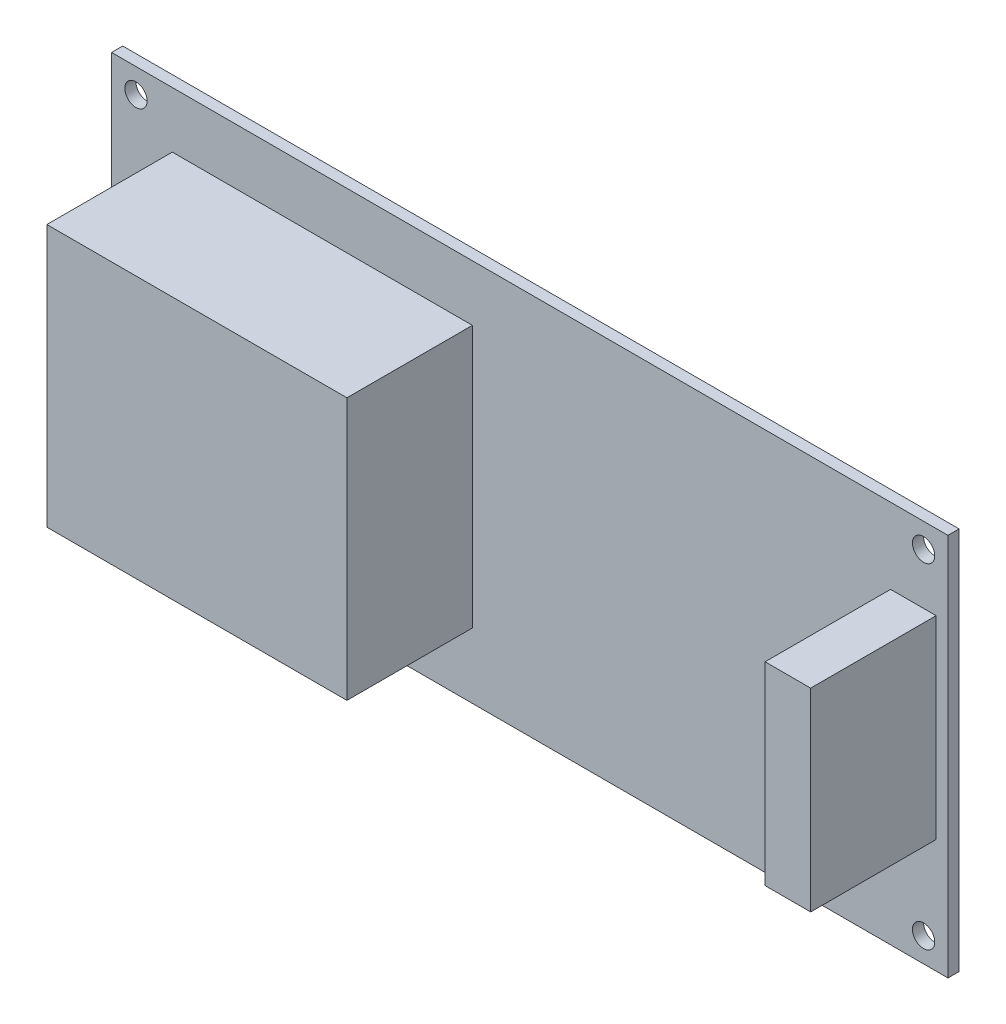
ISO-10303-21;
HEADER;
FILE_DESCRIPTION(('STEP AP214'),'2;1');
FILE_NAME('part.step','',(''),(''),'','','');
FILE_SCHEMA(('AUTOMOTIVE_DESIGN { 1 0 10303 214 1 1 1 1 }'));
ENDSEC;
DATA;
#1=APPLICATION_CONTEXT('core data for automotive mechanical design processes');
#2=APPLICATION_PROTOCOL_DEFINITION('international standard','automotive_design',2000,#1);
#3=PRODUCT_CONTEXT('',#1,'mechanical');
#4=PRODUCT('Part','Part','',(#3));
#5=PRODUCT_RELATED_PRODUCT_CATEGORY('part','',(#4));
#6=PRODUCT_DEFINITION_FORMATION('','',#4);
#7=PRODUCT_DEFINITION_CONTEXT('part definition',#1,'design');
#8=PRODUCT_DEFINITION('design','',#6,#7);
#9=PRODUCT_DEFINITION_SHAPE('','',#8);
#10=(LENGTH_UNIT() NAMED_UNIT(*) SI_UNIT(.MILLI.,.METRE.));
#11=(NAMED_UNIT(*) PLANE_ANGLE_UNIT() SI_UNIT($,.RADIAN.));
#12=(NAMED_UNIT(*) SI_UNIT($,.STERADIAN.) SOLID_ANGLE_UNIT());
#13=UNCERTAINTY_MEASURE_WITH_UNIT(LENGTH_MEASURE(1.E-05),#10,'distance_accuracy_value','');
#14=(GEOMETRIC_REPRESENTATION_CONTEXT(3) GLOBAL_UNCERTAINTY_ASSIGNED_CONTEXT((#13)) GLOBAL_UNIT_ASSIGNED_CONTEXT((#10,
#11,#12)) REPRESENTATION_CONTEXT('',''));
#15=CARTESIAN_POINT('',(0.,0.,0.));
#16=DIRECTION('',(0.,0.,1.));
#17=DIRECTION('',(1.,0.,0.));
#18=AXIS2_PLACEMENT_3D('',#15,#16,#17);
#19=CARTESIAN_POINT('',(0.,0.,1.6));
#20=DIRECTION('',(0.,0.,1.));
#21=DIRECTION('',(1.,0.,0.));
#22=AXIS2_PLACEMENT_3D('',#19,#20,#21);
#23=PLANE('',#22);
#24=DIRECTION('',(0.,-1.,0.));
#25=VECTOR('',#24,1.);
#26=CARTESIAN_POINT('',(-8.23253103883559,0.,1.6));
#27=LINE('',#26,#25);
#28=CARTESIAN_POINT('',(-8.23253103883559,19.4768407043568,1.6));
#29=VERTEX_POINT('',#28);
#30=CARTESIAN_POINT('',(-8.23253103883559,-18.1267238571365,1.6));
#31=VERTEX_POINT('',#30);
#32=EDGE_CURVE('E147',#29,#31,#27,.T.);
#33=ORIENTED_EDGE('',*,*,#32,.T.);
#34=DIRECTION('',(1.,0.,0.));
#35=VECTOR('',#34,1.);
#36=CARTESIAN_POINT('',(0.,-18.1267238571365,1.6));
#37=LINE('',#36,#35);
#38=CARTESIAN_POINT('',(-51.2828434672272,-18.1267238571365,1.6));
#39=VERTEX_POINT('',#38);
#40=EDGE_CURVE('E167',#39,#31,#37,.T.);
#41=ORIENTED_EDGE('',*,*,#40,.F.);
#42=DIRECTION('',(0.,-1.,0.));
#43=VECTOR('',#42,1.);
#44=CARTESIAN_POINT('',(-51.2828434672272,0.,1.6));
#45=LINE('',#44,#43);
#46=CARTESIAN_POINT('',(-51.2828434672272,19.4768407043568,1.6));
#47=VERTEX_POINT('',#46);
#48=EDGE_CURVE('E177',#47,#39,#45,.T.);
#49=ORIENTED_EDGE('',*,*,#48,.F.);
#50=DIRECTION('',(1.,0.,0.));
#51=VECTOR('',#50,1.);
#52=CARTESIAN_POINT('',(0.,19.4768407043568,1.6));
#53=LINE('',#52,#51);
#54=EDGE_CURVE('E150',#47,#29,#53,.T.);
#55=ORIENTED_EDGE('',*,*,#54,.T.);
#56=EDGE_LOOP('',(#33,#41,#49,#55));
#57=FACE_BOUND('',#56,.T.);
#58=CARTESIAN_POINT('',(56.5,-24.,1.6));
#59=DIRECTION('',(0.,0.,1.));
#60=DIRECTION('',(1.,0.,0.));
#61=AXIS2_PLACEMENT_3D('',#58,#59,#60);
#62=CIRCLE('',#61,1.6);
#63=CARTESIAN_POINT('',(58.1,-24.,1.6));
#64=VERTEX_POINT('',#63);
#65=EDGE_CURVE('E193',#64,#64,#62,.T.);
#66=ORIENTED_EDGE('',*,*,#65,.F.);
#67=EDGE_LOOP('',(#66));
#68=FACE_BOUND('',#67,.T.);
#69=CARTESIAN_POINT('',(-56.5,24.,1.6));
#70=DIRECTION('',(0.,0.,1.));
#71=DIRECTION('',(1.,0.,0.));
#72=AXIS2_PLACEMENT_3D('',#69,#70,#71);
#73=CIRCLE('',#72,1.6);
#74=CARTESIAN_POINT('',(-54.9,24.,1.6));
#75=VERTEX_POINT('',#74);
#76=EDGE_CURVE('E205',#75,#75,#73,.T.);
#77=ORIENTED_EDGE('',*,*,#76,.F.);
#78=EDGE_LOOP('',(#77));
#79=FACE_BOUND('',#78,.T.);
#80=DIRECTION('',(0.,-1.,0.));
#81=VECTOR('',#80,1.);
#82=CARTESIAN_POINT('',(-60.,27.5,1.6));
#83=LINE('',#82,#81);
#84=CARTESIAN_POINT('',(-60.,27.5,1.6));
#85=VERTEX_POINT('',#84);
#86=CARTESIAN_POINT('',(-60.,-27.5,1.6));
#87=VERTEX_POINT('',#86);
#88=EDGE_CURVE('E211',#85,#87,#83,.T.);
#89=ORIENTED_EDGE('',*,*,#88,.T.);
#90=DIRECTION('',(1.,0.,0.));
#91=VECTOR('',#90,1.);
#92=CARTESIAN_POINT('',(-60.,-27.5,1.6));
#93=LINE('',#92,#91);
#94=CARTESIAN_POINT('',(60.,-27.5,1.6));
#95=VERTEX_POINT('',#94);
#96=EDGE_CURVE('E214',#87,#95,#93,.T.);
#97=ORIENTED_EDGE('',*,*,#96,.T.);
#98=DIRECTION('',(0.,1.,0.));
#99=VECTOR('',#98,1.);
#100=CARTESIAN_POINT('',(60.,27.5,1.6));
#101=LINE('',#100,#99);
#102=CARTESIAN_POINT('',(60.,27.5,1.6));
#103=VERTEX_POINT('',#102);
#104=EDGE_CURVE('E217',#95,#103,#101,.T.);
#105=ORIENTED_EDGE('',*,*,#104,.T.);
#106=DIRECTION('',(-1.,0.,0.));
#107=VECTOR('',#106,1.);
#108=CARTESIAN_POINT('',(-60.,27.5,1.6));
#109=LINE('',#108,#107);
#110=EDGE_CURVE('E219',#103,#85,#109,.T.);
#111=ORIENTED_EDGE('',*,*,#110,.T.);
#112=EDGE_LOOP('',(#89,#97,#105,#111));
#113=FACE_BOUND('',#112,.T.);
#114=CARTESIAN_POINT('',(56.5,24.,1.6));
#115=DIRECTION('',(0.,0.,1.));
#116=DIRECTION('',(1.,0.,0.));
#117=AXIS2_PLACEMENT_3D('',#114,#115,#116);
#118=CIRCLE('',#117,1.6);
#119=CARTESIAN_POINT('',(58.1,24.,1.6));
#120=VERTEX_POINT('',#119);
#121=EDGE_CURVE('E199',#120,#120,#118,.T.);
#122=ORIENTED_EDGE('',*,*,#121,.F.);
#123=EDGE_LOOP('',(#122));
#124=FACE_BOUND('',#123,.T.);
#125=CARTESIAN_POINT('',(-56.5,-24.,1.6));
#126=DIRECTION('',(0.,0.,1.));
#127=DIRECTION('',(1.,0.,0.));
#128=AXIS2_PLACEMENT_3D('',#125,#126,#127);
#129=CIRCLE('',#128,1.6);
#130=CARTESIAN_POINT('',(-54.9,-24.,1.6));
#131=VERTEX_POINT('',#130);
#132=EDGE_CURVE('E187',#131,#131,#129,.T.);
#133=ORIENTED_EDGE('',*,*,#132,.F.);
#134=EDGE_LOOP('',(#133));
#135=FACE_BOUND('',#134,.T.);
#136=DIRECTION('',(0.,-1.,0.));
#137=VECTOR('',#136,1.);
#138=CARTESIAN_POINT('',(58.2996946635816,16.6696828347597,1.6));
#139=LINE('',#138,#137);
#140=CARTESIAN_POINT('',(58.2996946635816,16.6696828347597,1.6));
#141=VERTEX_POINT('',#140);
#142=CARTESIAN_POINT('',(58.2996946635816,-11.1451647953231,1.6));
#143=VERTEX_POINT('',#142);
#144=EDGE_CURVE('E146',#141,#143,#139,.T.);
#145=ORIENTED_EDGE('',*,*,#144,.T.);
#146=DIRECTION('',(1.,0.,0.));
#147=VECTOR('',#146,1.);
#148=CARTESIAN_POINT('',(51.7604993249776,-11.1451647953231,1.6));
#149=LINE('',#148,#147);
#150=CARTESIAN_POINT('',(51.7604993249776,-11.1451647953231,1.6));
#151=VERTEX_POINT('',#150);
#152=EDGE_CURVE('E141',#151,#143,#149,.T.);
#153=ORIENTED_EDGE('',*,*,#152,.F.);
#154=DIRECTION('',(0.,-1.,0.));
#155=VECTOR('',#154,1.);
#156=CARTESIAN_POINT('',(51.7604993249776,16.6696828347597,1.6));
#157=LINE('',#156,#155);
#158=CARTESIAN_POINT('',(51.7604993249776,16.6696828347597,1.6));
#159=VERTEX_POINT('',#158);
#160=EDGE_CURVE('E126',#159,#151,#157,.T.);
#161=ORIENTED_EDGE('',*,*,#160,.F.);
#162=DIRECTION('',(1.,0.,0.));
#163=VECTOR('',#162,1.);
#164=CARTESIAN_POINT('',(51.7604993249776,16.6696828347597,1.6));
#165=LINE('',#164,#163);
#166=EDGE_CURVE('E50',#159,#141,#165,.T.);
#167=ORIENTED_EDGE('',*,*,#166,.T.);
#168=EDGE_LOOP('',(#145,#153,#161,#167));
#169=FACE_BOUND('',#168,.T.);
#170=ADVANCED_FACE('F35',(#57,#68,#79,#113,#124,#135,#169),#23,.T.);
#171=CARTESIAN_POINT('',(0.,0.,0.));
#172=DIRECTION('',(0.,0.,1.));
#173=DIRECTION('',(1.,0.,0.));
#174=AXIS2_PLACEMENT_3D('',#171,#172,#173);
#175=PLANE('',#174);
#176=DIRECTION('',(0.,-1.,0.));
#177=VECTOR('',#176,1.);
#178=CARTESIAN_POINT('',(-60.,27.5,0.));
#179=LINE('',#178,#177);
#180=CARTESIAN_POINT('',(-60.,27.5,0.));
#181=VERTEX_POINT('',#180);
#182=CARTESIAN_POINT('',(-60.,-27.5,0.));
#183=VERTEX_POINT('',#182);
#184=EDGE_CURVE('E208',#181,#183,#179,.T.);
#185=ORIENTED_EDGE('',*,*,#184,.F.);
#186=DIRECTION('',(-1.,0.,0.));
#187=VECTOR('',#186,1.);
#188=CARTESIAN_POINT('',(-60.,27.5,0.));
#189=LINE('',#188,#187);
#190=CARTESIAN_POINT('',(60.,27.5,0.));
#191=VERTEX_POINT('',#190);
#192=EDGE_CURVE('E215',#191,#181,#189,.T.);
#193=ORIENTED_EDGE('',*,*,#192,.F.);
#194=DIRECTION('',(0.,1.,0.));
#195=VECTOR('',#194,1.);
#196=CARTESIAN_POINT('',(60.,27.5,0.));
#197=LINE('',#196,#195);
#198=CARTESIAN_POINT('',(60.,-27.5,0.));
#199=VERTEX_POINT('',#198);
#200=EDGE_CURVE('E226',#199,#191,#197,.T.);
#201=ORIENTED_EDGE('',*,*,#200,.F.);
#202=DIRECTION('',(1.,0.,0.));
#203=VECTOR('',#202,1.);
#204=CARTESIAN_POINT('',(-60.,-27.5,0.));
#205=LINE('',#204,#203);
#206=EDGE_CURVE('E224',#183,#199,#205,.T.);
#207=ORIENTED_EDGE('',*,*,#206,.F.);
#208=EDGE_LOOP('',(#185,#193,#201,#207));
#209=FACE_BOUND('',#208,.T.);
#210=CARTESIAN_POINT('',(-56.5,24.,0.));
#211=DIRECTION('',(0.,0.,1.));
#212=DIRECTION('',(1.,0.,0.));
#213=AXIS2_PLACEMENT_3D('',#210,#211,#212);
#214=CIRCLE('',#213,1.6);
#215=CARTESIAN_POINT('',(-54.9,24.,0.));
#216=VERTEX_POINT('',#215);
#217=EDGE_CURVE('E202',#216,#216,#214,.T.);
#218=ORIENTED_EDGE('',*,*,#217,.T.);
#219=EDGE_LOOP('',(#218));
#220=FACE_BOUND('',#219,.T.);
#221=CARTESIAN_POINT('',(56.5,24.,0.));
#222=DIRECTION('',(0.,0.,1.));
#223=DIRECTION('',(1.,0.,0.));
#224=AXIS2_PLACEMENT_3D('',#221,#222,#223);
#225=CIRCLE('',#224,1.6);
#226=CARTESIAN_POINT('',(58.1,24.,0.));
#227=VERTEX_POINT('',#226);
#228=EDGE_CURVE('E196',#227,#227,#225,.T.);
#229=ORIENTED_EDGE('',*,*,#228,.T.);
#230=EDGE_LOOP('',(#229));
#231=FACE_BOUND('',#230,.T.);
#232=CARTESIAN_POINT('',(56.5,-24.,0.));
#233=DIRECTION('',(0.,0.,1.));
#234=DIRECTION('',(1.,0.,0.));
#235=AXIS2_PLACEMENT_3D('',#232,#233,#234);
#236=CIRCLE('',#235,1.6);
#237=CARTESIAN_POINT('',(58.1,-24.,0.));
#238=VERTEX_POINT('',#237);
#239=EDGE_CURVE('E190',#238,#238,#236,.T.);
#240=ORIENTED_EDGE('',*,*,#239,.T.);
#241=EDGE_LOOP('',(#240));
#242=FACE_BOUND('',#241,.T.);
#243=CARTESIAN_POINT('',(-56.5,-24.,0.));
#244=DIRECTION('',(0.,0.,1.));
#245=DIRECTION('',(1.,0.,0.));
#246=AXIS2_PLACEMENT_3D('',#243,#244,#245);
#247=CIRCLE('',#246,1.6);
#248=CARTESIAN_POINT('',(-54.9,-24.,0.));
#249=VERTEX_POINT('',#248);
#250=EDGE_CURVE('E186',#249,#249,#247,.T.);
#251=ORIENTED_EDGE('',*,*,#250,.T.);
#252=EDGE_LOOP('',(#251));
#253=FACE_BOUND('',#252,.T.);
#254=ADVANCED_FACE('F244',(#209,#220,#231,#242,#253),#175,.F.);
#255=CARTESIAN_POINT('',(-60.,27.5,1.6));
#256=DIRECTION('',(1.,0.,0.));
#257=DIRECTION('',(0.,0.,-1.));
#258=AXIS2_PLACEMENT_3D('',#255,#256,#257);
#259=PLANE('',#258);
#260=ORIENTED_EDGE('',*,*,#184,.T.);
#261=DIRECTION('',(0.,0.,-1.));
#262=VECTOR('',#261,1.);
#263=CARTESIAN_POINT('',(-60.,-27.5,1.6));
#264=LINE('',#263,#262);
#265=EDGE_CURVE('E11',#87,#183,#264,.T.);
#266=ORIENTED_EDGE('',*,*,#265,.F.);
#267=ORIENTED_EDGE('',*,*,#88,.F.);
#268=DIRECTION('',(0.,0.,-1.));
#269=VECTOR('',#268,1.);
#270=CARTESIAN_POINT('',(-60.,27.5,1.6));
#271=LINE('',#270,#269);
#272=EDGE_CURVE('E221',#85,#181,#271,.T.);
#273=ORIENTED_EDGE('',*,*,#272,.T.);
#274=EDGE_LOOP('',(#260,#266,#267,#273));
#275=FACE_BOUND('',#274,.T.);
#276=ADVANCED_FACE('F37',(#275),#259,.F.);
#277=CARTESIAN_POINT('',(-60.,-27.5,1.6));
#278=DIRECTION('',(0.,1.,0.));
#279=DIRECTION('',(-1.,0.,0.));
#280=AXIS2_PLACEMENT_3D('',#277,#278,#279);
#281=PLANE('',#280);
#282=ORIENTED_EDGE('',*,*,#206,.T.);
#283=DIRECTION('',(0.,0.,-1.));
#284=VECTOR('',#283,1.);
#285=CARTESIAN_POINT('',(60.,-27.5,1.6));
#286=LINE('',#285,#284);
#287=EDGE_CURVE('E43',#95,#199,#286,.T.);
#288=ORIENTED_EDGE('',*,*,#287,.F.);
#289=ORIENTED_EDGE('',*,*,#96,.F.);
#290=ORIENTED_EDGE('',*,*,#265,.T.);
#291=EDGE_LOOP('',(#282,#288,#289,#290));
#292=FACE_BOUND('',#291,.T.);
#293=ADVANCED_FACE('F255',(#292),#281,.F.);
#294=CARTESIAN_POINT('',(60.,27.5,1.6));
#295=DIRECTION('',(-1.,0.,0.));
#296=DIRECTION('',(0.,0.,1.));
#297=AXIS2_PLACEMENT_3D('',#294,#295,#296);
#298=PLANE('',#297);
#299=ORIENTED_EDGE('',*,*,#200,.T.);
#300=DIRECTION('',(0.,0.,-1.));
#301=VECTOR('',#300,1.);
#302=CARTESIAN_POINT('',(60.,27.5,1.6));
#303=LINE('',#302,#301);
#304=EDGE_CURVE('E231',#103,#191,#303,.T.);
#305=ORIENTED_EDGE('',*,*,#304,.F.);
#306=ORIENTED_EDGE('',*,*,#104,.F.);
#307=ORIENTED_EDGE('',*,*,#287,.T.);
#308=EDGE_LOOP('',(#299,#305,#306,#307));
#309=FACE_BOUND('',#308,.T.);
#310=ADVANCED_FACE('F238',(#309),#298,.F.);
#311=CARTESIAN_POINT('',(-60.,27.5,1.6));
#312=DIRECTION('',(0.,-1.,0.));
#313=DIRECTION('',(0.,0.,-1.));
#314=AXIS2_PLACEMENT_3D('',#311,#312,#313);
#315=PLANE('',#314);
#316=ORIENTED_EDGE('',*,*,#192,.T.);
#317=ORIENTED_EDGE('',*,*,#272,.F.);
#318=ORIENTED_EDGE('',*,*,#110,.F.);
#319=ORIENTED_EDGE('',*,*,#304,.T.);
#320=EDGE_LOOP('',(#316,#317,#318,#319));
#321=FACE_BOUND('',#320,.T.);
#322=ADVANCED_FACE('F248',(#321),#315,.F.);
#323=CARTESIAN_POINT('',(-56.5,24.,1.6));
#324=DIRECTION('',(0.,0.,-1.));
#325=DIRECTION('',(-1.,0.,0.));
#326=AXIS2_PLACEMENT_3D('',#323,#324,#325);
#327=CYLINDRICAL_SURFACE('',#326,1.6);
#328=ORIENTED_EDGE('',*,*,#76,.T.);
#329=EDGE_LOOP('',(#328));
#330=FACE_BOUND('',#329,.T.);
#331=ORIENTED_EDGE('',*,*,#217,.F.);
#332=EDGE_LOOP('',(#331));
#333=FACE_BOUND('',#332,.T.);
#334=ADVANCED_FACE('F271',(#330,#333),#327,.F.);
#335=CARTESIAN_POINT('',(56.5,24.,1.6));
#336=DIRECTION('',(0.,0.,-1.));
#337=DIRECTION('',(-1.,0.,0.));
#338=AXIS2_PLACEMENT_3D('',#335,#336,#337);
#339=CYLINDRICAL_SURFACE('',#338,1.6);
#340=ORIENTED_EDGE('',*,*,#121,.T.);
#341=EDGE_LOOP('',(#340));
#342=FACE_BOUND('',#341,.T.);
#343=ORIENTED_EDGE('',*,*,#228,.F.);
#344=EDGE_LOOP('',(#343));
#345=FACE_BOUND('',#344,.T.);
#346=ADVANCED_FACE('F278',(#342,#345),#339,.F.);
#347=CARTESIAN_POINT('',(56.5,-24.,1.6));
#348=DIRECTION('',(0.,0.,-1.));
#349=DIRECTION('',(-1.,0.,0.));
#350=AXIS2_PLACEMENT_3D('',#347,#348,#349);
#351=CYLINDRICAL_SURFACE('',#350,1.6);
#352=ORIENTED_EDGE('',*,*,#65,.T.);
#353=EDGE_LOOP('',(#352));
#354=FACE_BOUND('',#353,.T.);
#355=ORIENTED_EDGE('',*,*,#239,.F.);
#356=EDGE_LOOP('',(#355));
#357=FACE_BOUND('',#356,.T.);
#358=ADVANCED_FACE('F283',(#354,#357),#351,.F.);
#359=CARTESIAN_POINT('',(-56.5,-24.,1.6));
#360=DIRECTION('',(0.,0.,-1.));
#361=DIRECTION('',(-1.,0.,0.));
#362=AXIS2_PLACEMENT_3D('',#359,#360,#361);
#363=CYLINDRICAL_SURFACE('',#362,1.6);
#364=ORIENTED_EDGE('',*,*,#132,.T.);
#365=EDGE_LOOP('',(#364));
#366=FACE_BOUND('',#365,.T.);
#367=ORIENTED_EDGE('',*,*,#250,.F.);
#368=EDGE_LOOP('',(#367));
#369=FACE_BOUND('',#368,.T.);
#370=ADVANCED_FACE('F295',(#366,#369),#363,.F.);
#371=CARTESIAN_POINT('',(-8.23253103883559,0.,19.6));
#372=DIRECTION('',(1.,0.,0.));
#373=DIRECTION('',(0.,0.,-1.));
#374=AXIS2_PLACEMENT_3D('',#371,#372,#373);
#375=PLANE('',#374);
#376=ORIENTED_EDGE('',*,*,#32,.F.);
#377=DIRECTION('',(0.,0.,-1.));
#378=VECTOR('',#377,1.);
#379=CARTESIAN_POINT('',(-8.23253103883559,19.4768407043568,19.6));
#380=LINE('',#379,#378);
#381=CARTESIAN_POINT('',(-8.23253103883559,19.4768407043568,19.6));
#382=VERTEX_POINT('',#381);
#383=EDGE_CURVE('E184',#382,#29,#380,.T.);
#384=ORIENTED_EDGE('',*,*,#383,.F.);
#385=DIRECTION('',(0.,-1.,0.));
#386=VECTOR('',#385,1.);
#387=CARTESIAN_POINT('',(-8.23253103883559,0.,19.6));
#388=LINE('',#387,#386);
#389=CARTESIAN_POINT('',(-8.23253103883559,-18.1267238571365,19.6));
#390=VERTEX_POINT('',#389);
#391=EDGE_CURVE('E163',#382,#390,#388,.T.);
#392=ORIENTED_EDGE('',*,*,#391,.T.);
#393=DIRECTION('',(0.,0.,-1.));
#394=VECTOR('',#393,1.);
#395=CARTESIAN_POINT('',(-8.23253103883559,-18.1267238571365,19.6));
#396=LINE('',#395,#394);
#397=EDGE_CURVE('E173',#390,#31,#396,.T.);
#398=ORIENTED_EDGE('',*,*,#397,.T.);
#399=EDGE_LOOP('',(#376,#384,#392,#398));
#400=FACE_BOUND('',#399,.T.);
#401=ADVANCED_FACE('F297',(#400),#375,.T.);
#402=CARTESIAN_POINT('',(0.,19.4768407043568,19.6));
#403=DIRECTION('',(0.,1.,0.));
#404=DIRECTION('',(0.,0.,1.));
#405=AXIS2_PLACEMENT_3D('',#402,#403,#404);
#406=PLANE('',#405);
#407=ORIENTED_EDGE('',*,*,#54,.F.);
#408=DIRECTION('',(0.,0.,-1.));
#409=VECTOR('',#408,1.);
#410=CARTESIAN_POINT('',(-51.2828434672272,19.4768407043568,19.6));
#411=LINE('',#410,#409);
#412=CARTESIAN_POINT('',(-51.2828434672272,19.4768407043568,19.6));
#413=VERTEX_POINT('',#412);
#414=EDGE_CURVE('E182',#413,#47,#411,.T.);
#415=ORIENTED_EDGE('',*,*,#414,.F.);
#416=DIRECTION('',(1.,0.,0.));
#417=VECTOR('',#416,1.);
#418=CARTESIAN_POINT('',(0.,19.4768407043568,19.6));
#419=LINE('',#418,#417);
#420=EDGE_CURVE('E166',#413,#382,#419,.T.);
#421=ORIENTED_EDGE('',*,*,#420,.T.);
#422=ORIENTED_EDGE('',*,*,#383,.T.);
#423=EDGE_LOOP('',(#407,#415,#421,#422));
#424=FACE_BOUND('',#423,.T.);
#425=ADVANCED_FACE('F304',(#424),#406,.T.);
#426=CARTESIAN_POINT('',(-51.2828434672272,0.,19.6));
#427=DIRECTION('',(1.,0.,0.));
#428=DIRECTION('',(0.,0.,-1.));
#429=AXIS2_PLACEMENT_3D('',#426,#427,#428);
#430=PLANE('',#429);
#431=ORIENTED_EDGE('',*,*,#48,.T.);
#432=DIRECTION('',(0.,0.,-1.));
#433=VECTOR('',#432,1.);
#434=CARTESIAN_POINT('',(-51.2828434672272,-18.1267238571365,19.6));
#435=LINE('',#434,#433);
#436=CARTESIAN_POINT('',(-51.2828434672272,-18.1267238571365,19.6));
#437=VERTEX_POINT('',#436);
#438=EDGE_CURVE('E58',#437,#39,#435,.T.);
#439=ORIENTED_EDGE('',*,*,#438,.F.);
#440=DIRECTION('',(0.,-1.,0.));
#441=VECTOR('',#440,1.);
#442=CARTESIAN_POINT('',(-51.2828434672272,0.,19.6));
#443=LINE('',#442,#441);
#444=EDGE_CURVE('E170',#413,#437,#443,.T.);
#445=ORIENTED_EDGE('',*,*,#444,.F.);
#446=ORIENTED_EDGE('',*,*,#414,.T.);
#447=EDGE_LOOP('',(#431,#439,#445,#446));
#448=FACE_BOUND('',#447,.T.);
#449=ADVANCED_FACE('F312',(#448),#430,.F.);
#450=CARTESIAN_POINT('',(0.,-18.1267238571365,19.6));
#451=DIRECTION('',(0.,1.,0.));
#452=DIRECTION('',(0.,0.,1.));
#453=AXIS2_PLACEMENT_3D('',#450,#451,#452);
#454=PLANE('',#453);
#455=ORIENTED_EDGE('',*,*,#40,.T.);
#456=ORIENTED_EDGE('',*,*,#397,.F.);
#457=DIRECTION('',(1.,0.,0.));
#458=VECTOR('',#457,1.);
#459=CARTESIAN_POINT('',(0.,-18.1267238571365,19.6));
#460=LINE('',#459,#458);
#461=EDGE_CURVE('E172',#437,#390,#460,.T.);
#462=ORIENTED_EDGE('',*,*,#461,.F.);
#463=ORIENTED_EDGE('',*,*,#438,.T.);
#464=EDGE_LOOP('',(#455,#456,#462,#463));
#465=FACE_BOUND('',#464,.T.);
#466=ADVANCED_FACE('F316',(#465),#454,.F.);
#467=CARTESIAN_POINT('',(0.,0.,19.6));
#468=DIRECTION('',(0.,0.,1.));
#469=DIRECTION('',(1.,0.,0.));
#470=AXIS2_PLACEMENT_3D('',#467,#468,#469);
#471=PLANE('',#470);
#472=ORIENTED_EDGE('',*,*,#391,.F.);
#473=ORIENTED_EDGE('',*,*,#420,.F.);
#474=ORIENTED_EDGE('',*,*,#444,.T.);
#475=ORIENTED_EDGE('',*,*,#461,.T.);
#476=EDGE_LOOP('',(#472,#473,#474,#475));
#477=FACE_BOUND('',#476,.T.);
#478=ADVANCED_FACE('F320',(#477),#471,.T.);
#479=CARTESIAN_POINT('',(51.7604993249776,-11.1451647953231,19.6));
#480=DIRECTION('',(0.,1.,0.));
#481=DIRECTION('',(0.,0.,1.));
#482=AXIS2_PLACEMENT_3D('',#479,#480,#481);
#483=PLANE('',#482);
#484=ORIENTED_EDGE('',*,*,#152,.T.);
#485=DIRECTION('',(0.,0.,-1.));
#486=VECTOR('',#485,1.);
#487=CARTESIAN_POINT('',(58.2996946635816,-11.1451647953231,19.6));
#488=LINE('',#487,#486);
#489=CARTESIAN_POINT('',(58.2996946635816,-11.1451647953231,19.6));
#490=VERTEX_POINT('',#489);
#491=EDGE_CURVE('E450',#490,#143,#488,.T.);
#492=ORIENTED_EDGE('',*,*,#491,.F.);
#493=DIRECTION('',(1.,0.,0.));
#494=VECTOR('',#493,1.);
#495=CARTESIAN_POINT('',(51.7604993249776,-11.1451647953231,19.6));
#496=LINE('',#495,#494);
#497=CARTESIAN_POINT('',(51.7604993249776,-11.1451647953231,19.6));
#498=VERTEX_POINT('',#497);
#499=EDGE_CURVE('E135',#498,#490,#496,.T.);
#500=ORIENTED_EDGE('',*,*,#499,.F.);
#501=DIRECTION('',(0.,0.,-1.));
#502=VECTOR('',#501,1.);
#503=CARTESIAN_POINT('',(51.7604993249776,-11.1451647953231,19.6));
#504=LINE('',#503,#502);
#505=EDGE_CURVE('E130',#498,#151,#504,.T.);
#506=ORIENTED_EDGE('',*,*,#505,.T.);
#507=EDGE_LOOP('',(#484,#492,#500,#506));
#508=FACE_BOUND('',#507,.T.);
#509=ADVANCED_FACE('F139',(#508),#483,.F.);
#510=CARTESIAN_POINT('',(58.2996946635816,16.6696828347597,19.6));
#511=DIRECTION('',(1.,0.,0.));
#512=DIRECTION('',(0.,0.,-1.));
#513=AXIS2_PLACEMENT_3D('',#510,#511,#512);
#514=PLANE('',#513);
#515=ORIENTED_EDGE('',*,*,#144,.F.);
#516=DIRECTION('',(0.,0.,-1.));
#517=VECTOR('',#516,1.);
#518=CARTESIAN_POINT('',(58.2996946635816,16.6696828347597,19.6));
#519=LINE('',#518,#517);
#520=CARTESIAN_POINT('',(58.2996946635816,16.6696828347597,19.6));
#521=VERTEX_POINT('',#520);
#522=EDGE_CURVE('E448',#521,#141,#519,.T.);
#523=ORIENTED_EDGE('',*,*,#522,.F.);
#524=DIRECTION('',(0.,-1.,0.));
#525=VECTOR('',#524,1.);
#526=CARTESIAN_POINT('',(58.2996946635816,16.6696828347597,19.6));
#527=LINE('',#526,#525);
#528=EDGE_CURVE('E159',#521,#490,#527,.T.);
#529=ORIENTED_EDGE('',*,*,#528,.T.);
#530=ORIENTED_EDGE('',*,*,#491,.T.);
#531=EDGE_LOOP('',(#515,#523,#529,#530));
#532=FACE_BOUND('',#531,.T.);
#533=ADVANCED_FACE('F333',(#532),#514,.T.);
#534=CARTESIAN_POINT('',(51.7604993249776,16.6696828347597,19.6));
#535=DIRECTION('',(0.,1.,0.));
#536=DIRECTION('',(0.,0.,1.));
#537=AXIS2_PLACEMENT_3D('',#534,#535,#536);
#538=PLANE('',#537);
#539=ORIENTED_EDGE('',*,*,#166,.F.);
#540=DIRECTION('',(0.,0.,-1.));
#541=VECTOR('',#540,1.);
#542=CARTESIAN_POINT('',(51.7604993249776,16.6696828347597,19.6));
#543=LINE('',#542,#541);
#544=CARTESIAN_POINT('',(51.7604993249776,16.6696828347597,19.6));
#545=VERTEX_POINT('',#544);
#546=EDGE_CURVE('E132',#545,#159,#543,.T.);
#547=ORIENTED_EDGE('',*,*,#546,.F.);
#548=DIRECTION('',(1.,0.,0.));
#549=VECTOR('',#548,1.);
#550=CARTESIAN_POINT('',(51.7604993249776,16.6696828347597,19.6));
#551=LINE('',#550,#549);
#552=EDGE_CURVE('E156',#545,#521,#551,.T.);
#553=ORIENTED_EDGE('',*,*,#552,.T.);
#554=ORIENTED_EDGE('',*,*,#522,.T.);
#555=EDGE_LOOP('',(#539,#547,#553,#554));
#556=FACE_BOUND('',#555,.T.);
#557=ADVANCED_FACE('F330',(#556),#538,.T.);
#558=CARTESIAN_POINT('',(51.7604993249776,16.6696828347597,19.6));
#559=DIRECTION('',(1.,0.,0.));
#560=DIRECTION('',(0.,0.,-1.));
#561=AXIS2_PLACEMENT_3D('',#558,#559,#560);
#562=PLANE('',#561);
#563=ORIENTED_EDGE('',*,*,#160,.T.);
#564=ORIENTED_EDGE('',*,*,#505,.F.);
#565=DIRECTION('',(0.,-1.,0.));
#566=VECTOR('',#565,1.);
#567=CARTESIAN_POINT('',(51.7604993249776,16.6696828347597,19.6));
#568=LINE('',#567,#566);
#569=EDGE_CURVE('E143',#545,#498,#568,.T.);
#570=ORIENTED_EDGE('',*,*,#569,.F.);
#571=ORIENTED_EDGE('',*,*,#546,.T.);
#572=EDGE_LOOP('',(#563,#564,#570,#571));
#573=FACE_BOUND('',#572,.T.);
#574=ADVANCED_FACE('F128',(#573),#562,.F.);
#575=CARTESIAN_POINT('',(0.,0.,19.6));
#576=DIRECTION('',(0.,0.,-1.));
#577=DIRECTION('',(-1.,0.,0.));
#578=AXIS2_PLACEMENT_3D('',#575,#576,#577);
#579=PLANE('',#578);
#580=ORIENTED_EDGE('',*,*,#499,.T.);
#581=ORIENTED_EDGE('',*,*,#528,.F.);
#582=ORIENTED_EDGE('',*,*,#552,.F.);
#583=ORIENTED_EDGE('',*,*,#569,.T.);
#584=EDGE_LOOP('',(#580,#581,#582,#583));
#585=FACE_BOUND('',#584,.T.);
#586=ADVANCED_FACE('F324',(#585),#579,.F.);
#587=CLOSED_SHELL('',(#170,#254,#276,#293,#310,#322,#334,#346,#358,#370,#401,#425,#449,#466,
#478,#509,#533,#557,#574,#586));
#588=MANIFOLD_SOLID_BREP('B2',#587);
#589=ADVANCED_BREP_SHAPE_REPRESENTATION('',(#18,#588),#14);
#590=SHAPE_DEFINITION_REPRESENTATION(#9,#589);
ENDSEC;
END-ISO-10303-21;
